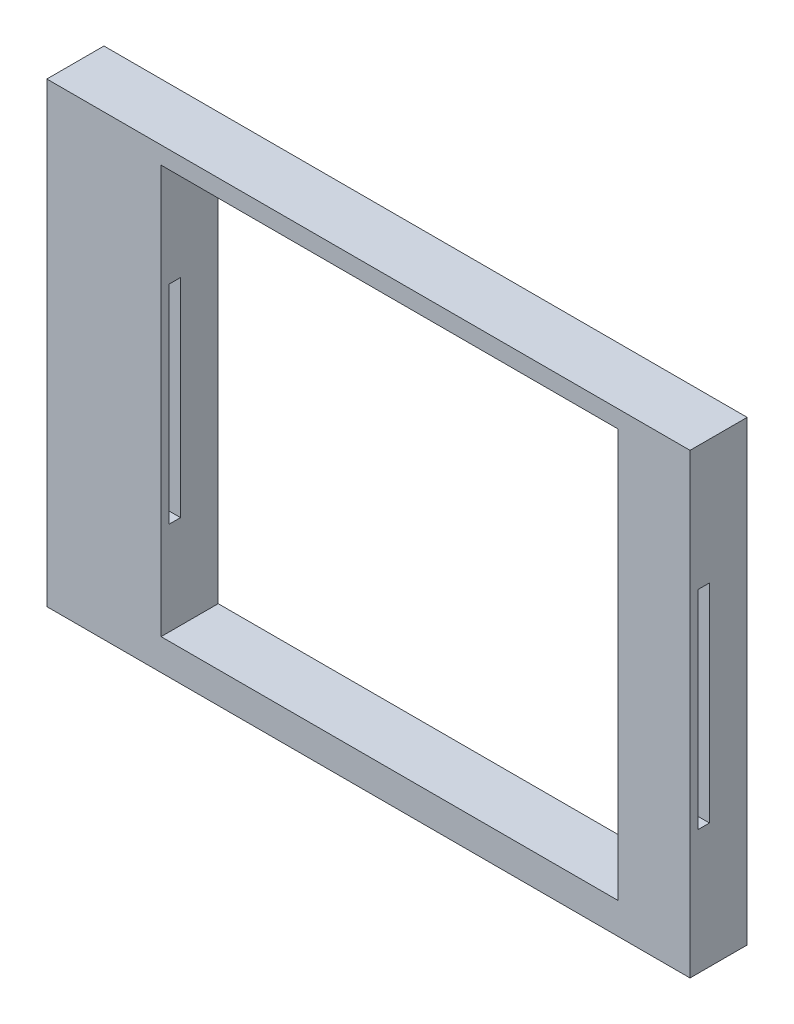
ISO-10303-21;
HEADER;
FILE_DESCRIPTION(('STEP AP214'),'2;1');
FILE_NAME('part.step','',(''),(''),'','','');
FILE_SCHEMA(('AUTOMOTIVE_DESIGN { 1 0 10303 214 1 1 1 1 }'));
ENDSEC;
DATA;
#1=APPLICATION_CONTEXT('core data for automotive mechanical design processes');
#2=APPLICATION_PROTOCOL_DEFINITION('international standard','automotive_design',2000,#1);
#3=PRODUCT_CONTEXT('',#1,'mechanical');
#4=PRODUCT('Part','Part','',(#3));
#5=PRODUCT_RELATED_PRODUCT_CATEGORY('part','',(#4));
#6=PRODUCT_DEFINITION_FORMATION('','',#4);
#7=PRODUCT_DEFINITION_CONTEXT('part definition',#1,'design');
#8=PRODUCT_DEFINITION('design','',#6,#7);
#9=PRODUCT_DEFINITION_SHAPE('','',#8);
#10=(LENGTH_UNIT() NAMED_UNIT(*) SI_UNIT(.MILLI.,.METRE.));
#11=(NAMED_UNIT(*) PLANE_ANGLE_UNIT() SI_UNIT($,.RADIAN.));
#12=(NAMED_UNIT(*) SI_UNIT($,.STERADIAN.) SOLID_ANGLE_UNIT());
#13=UNCERTAINTY_MEASURE_WITH_UNIT(LENGTH_MEASURE(1.E-05),#10,'distance_accuracy_value','');
#14=(GEOMETRIC_REPRESENTATION_CONTEXT(3) GLOBAL_UNCERTAINTY_ASSIGNED_CONTEXT((#13)) GLOBAL_UNIT_ASSIGNED_CONTEXT((#10,
#11,#12)) REPRESENTATION_CONTEXT('',''));
#15=CARTESIAN_POINT('',(0.,0.,0.));
#16=DIRECTION('',(0.,0.,1.));
#17=DIRECTION('',(1.,0.,0.));
#18=AXIS2_PLACEMENT_3D('',#15,#16,#17);
#19=CARTESIAN_POINT('',(0.,0.,5.));
#20=DIRECTION('',(0.,0.,1.));
#21=DIRECTION('',(1.,0.,0.));
#22=AXIS2_PLACEMENT_3D('',#19,#20,#21);
#23=PLANE('',#22);
#24=DIRECTION('',(0.,-1.,0.));
#25=VECTOR('',#24,1.);
#26=CARTESIAN_POINT('',(29.4938577719108,52.3731596494663,5.));
#27=LINE('',#26,#25);
#28=CARTESIAN_POINT('',(29.4938577719108,48.2000310900804,5.));
#29=VERTEX_POINT('',#28);
#30=CARTESIAN_POINT('',(29.4938577719108,8.2000310900804,5.));
#31=VERTEX_POINT('',#30);
#32=EDGE_CURVE('E146',#29,#31,#27,.T.);
#33=ORIENTED_EDGE('',*,*,#32,.F.);
#34=DIRECTION('',(-1.,0.,0.));
#35=VECTOR('',#34,1.);
#36=CARTESIAN_POINT('',(-26.8064344030394,48.2000310900804,5.));
#37=LINE('',#36,#35);
#38=CARTESIAN_POINT('',(-26.8064344030394,48.2000310900804,5.));
#39=VERTEX_POINT('',#38);
#40=EDGE_CURVE('E157',#29,#39,#37,.T.);
#41=ORIENTED_EDGE('',*,*,#40,.T.);
#42=DIRECTION('',(0.,-1.,0.));
#43=VECTOR('',#42,1.);
#44=CARTESIAN_POINT('',(-26.8064344030394,48.2000310900804,5.));
#45=LINE('',#44,#43);
#46=CARTESIAN_POINT('',(-26.8064344030394,8.2000310900804,5.));
#47=VERTEX_POINT('',#46);
#48=EDGE_CURVE('E168',#39,#47,#45,.T.);
#49=ORIENTED_EDGE('',*,*,#48,.T.);
#50=DIRECTION('',(1.,0.,0.));
#51=VECTOR('',#50,1.);
#52=CARTESIAN_POINT('',(-26.8064344030394,8.2000310900804,5.));
#53=LINE('',#52,#51);
#54=EDGE_CURVE('E159',#47,#31,#53,.T.);
#55=ORIENTED_EDGE('',*,*,#54,.T.);
#56=EDGE_LOOP('',(#33,#41,#49,#55));
#57=FACE_BOUND('',#56,.T.);
#58=DIRECTION('',(0.,1.,0.));
#59=VECTOR('',#58,1.);
#60=CARTESIAN_POINT('',(-16.8064344030394,38.2000310900804,5.));
#61=LINE('',#60,#59);
#62=CARTESIAN_POINT('',(-16.8064344030394,46.6700688000078,5.));
#63=VERTEX_POINT('',#62);
#64=CARTESIAN_POINT('',(-16.8064344030394,10.9264458946259,5.));
#65=VERTEX_POINT('',#64);
#66=EDGE_CURVE('E176',#63,#65,#61,.F.);
#67=ORIENTED_EDGE('',*,*,#66,.F.);
#68=DIRECTION('',(-1.,0.,0.));
#69=VECTOR('',#68,1.);
#70=CARTESIAN_POINT('',(-16.8064344030394,46.6700688000078,5.));
#71=LINE('',#70,#69);
#72=CARTESIAN_POINT('',(23.1969632366056,46.6700688000078,5.));
#73=VERTEX_POINT('',#72);
#74=EDGE_CURVE('E221',#73,#63,#71,.T.);
#75=ORIENTED_EDGE('',*,*,#74,.F.);
#76=DIRECTION('',(0.,1.,0.));
#77=VECTOR('',#76,1.);
#78=CARTESIAN_POINT('',(23.1969632366056,10.9264458946259,5.));
#79=LINE('',#78,#77);
#80=CARTESIAN_POINT('',(23.1969632366056,10.9264458946259,5.));
#81=VERTEX_POINT('',#80);
#82=EDGE_CURVE('E209',#81,#73,#79,.T.);
#83=ORIENTED_EDGE('',*,*,#82,.F.);
#84=DIRECTION('',(1.,0.,0.));
#85=VECTOR('',#84,1.);
#86=CARTESIAN_POINT('',(-16.8064344030394,10.9264458946259,5.));
#87=LINE('',#86,#85);
#88=EDGE_CURVE('E279',#65,#81,#87,.T.);
#89=ORIENTED_EDGE('',*,*,#88,.F.);
#90=EDGE_LOOP('',(#67,#75,#83,#89));
#91=FACE_BOUND('',#90,.T.);
#92=ADVANCED_FACE('F34',(#57,#91),#23,.T.);
#93=CARTESIAN_POINT('',(0.,0.,0.));
#94=DIRECTION('',(0.,0.,1.));
#95=DIRECTION('',(1.,0.,0.));
#96=AXIS2_PLACEMENT_3D('',#93,#94,#95);
#97=PLANE('',#96);
#98=DIRECTION('',(-1.,0.,0.));
#99=VECTOR('',#98,1.);
#100=CARTESIAN_POINT('',(-26.8064344030394,48.2000310900804,0.));
#101=LINE('',#100,#99);
#102=CARTESIAN_POINT('',(29.4938577719108,48.2000310900804,0.));
#103=VERTEX_POINT('',#102);
#104=CARTESIAN_POINT('',(-26.8064344030394,48.2000310900804,0.));
#105=VERTEX_POINT('',#104);
#106=EDGE_CURVE('E179',#103,#105,#101,.T.);
#107=ORIENTED_EDGE('',*,*,#106,.F.);
#108=DIRECTION('',(0.,-1.,0.));
#109=VECTOR('',#108,1.);
#110=CARTESIAN_POINT('',(29.4938577719108,0.,0.));
#111=LINE('',#110,#109);
#112=CARTESIAN_POINT('',(29.4938577719108,8.2000310900804,0.));
#113=VERTEX_POINT('',#112);
#114=EDGE_CURVE('E49',#103,#113,#111,.T.);
#115=ORIENTED_EDGE('',*,*,#114,.T.);
#116=DIRECTION('',(1.,0.,0.));
#117=VECTOR('',#116,1.);
#118=CARTESIAN_POINT('',(-26.8064344030394,8.2000310900804,0.));
#119=LINE('',#118,#117);
#120=CARTESIAN_POINT('',(-26.8064344030394,8.2000310900804,0.));
#121=VERTEX_POINT('',#120);
#122=EDGE_CURVE('E175',#121,#113,#119,.T.);
#123=ORIENTED_EDGE('',*,*,#122,.F.);
#124=DIRECTION('',(0.,-1.,0.));
#125=VECTOR('',#124,1.);
#126=CARTESIAN_POINT('',(-26.8064344030394,48.2000310900804,0.));
#127=LINE('',#126,#125);
#128=EDGE_CURVE('E172',#105,#121,#127,.T.);
#129=ORIENTED_EDGE('',*,*,#128,.F.);
#130=EDGE_LOOP('',(#107,#115,#123,#129));
#131=FACE_BOUND('',#130,.T.);
#132=DIRECTION('',(-1.,0.,0.));
#133=VECTOR('',#132,1.);
#134=CARTESIAN_POINT('',(0.,46.6700688000078,0.));
#135=LINE('',#134,#133);
#136=CARTESIAN_POINT('',(23.1969632366056,46.6700688000078,0.));
#137=VERTEX_POINT('',#136);
#138=CARTESIAN_POINT('',(-16.8064344030394,46.6700688000078,0.));
#139=VERTEX_POINT('',#138);
#140=EDGE_CURVE('E42',#137,#139,#135,.T.);
#141=ORIENTED_EDGE('',*,*,#140,.T.);
#142=DIRECTION('',(0.,-1.,0.));
#143=VECTOR('',#142,1.);
#144=CARTESIAN_POINT('',(-16.8064344030394,38.2000310900804,0.));
#145=LINE('',#144,#143);
#146=CARTESIAN_POINT('',(-16.8064344030394,10.9264458946259,0.));
#147=VERTEX_POINT('',#146);
#148=EDGE_CURVE('E185',#139,#147,#145,.T.);
#149=ORIENTED_EDGE('',*,*,#148,.T.);
#150=DIRECTION('',(1.,0.,0.));
#151=VECTOR('',#150,1.);
#152=CARTESIAN_POINT('',(0.,10.9264458946259,0.));
#153=LINE('',#152,#151);
#154=CARTESIAN_POINT('',(23.1969632366056,10.9264458946259,0.));
#155=VERTEX_POINT('',#154);
#156=EDGE_CURVE('E188',#147,#155,#153,.T.);
#157=ORIENTED_EDGE('',*,*,#156,.T.);
#158=DIRECTION('',(0.,1.,0.));
#159=VECTOR('',#158,1.);
#160=CARTESIAN_POINT('',(23.1969632366056,0.,0.));
#161=LINE('',#160,#159);
#162=EDGE_CURVE('E195',#155,#137,#161,.T.);
#163=ORIENTED_EDGE('',*,*,#162,.T.);
#164=EDGE_LOOP('',(#141,#149,#157,#163));
#165=FACE_BOUND('',#164,.T.);
#166=ADVANCED_FACE('F193',(#131,#165),#97,.F.);
#167=CARTESIAN_POINT('',(-26.8064344030394,48.2000310900804,5.));
#168=DIRECTION('',(1.,0.,0.));
#169=DIRECTION('',(0.,0.,-1.));
#170=AXIS2_PLACEMENT_3D('',#167,#168,#169);
#171=PLANE('',#170);
#172=ORIENTED_EDGE('',*,*,#128,.T.);
#173=DIRECTION('',(0.,0.,-1.));
#174=VECTOR('',#173,1.);
#175=CARTESIAN_POINT('',(-26.8064344030394,8.2000310900804,5.));
#176=LINE('',#175,#174);
#177=EDGE_CURVE('E166',#47,#121,#176,.T.);
#178=ORIENTED_EDGE('',*,*,#177,.F.);
#179=ORIENTED_EDGE('',*,*,#48,.F.);
#180=DIRECTION('',(0.,0.,-1.));
#181=VECTOR('',#180,1.);
#182=CARTESIAN_POINT('',(-26.8064344030394,48.2000310900804,5.));
#183=LINE('',#182,#181);
#184=EDGE_CURVE('E163',#39,#105,#183,.T.);
#185=ORIENTED_EDGE('',*,*,#184,.T.);
#186=EDGE_LOOP('',(#172,#178,#179,#185));
#187=FACE_BOUND('',#186,.T.);
#188=ADVANCED_FACE('F36',(#187),#171,.F.);
#189=CARTESIAN_POINT('',(-26.8064344030394,8.2000310900804,5.));
#190=DIRECTION('',(0.,1.,0.));
#191=DIRECTION('',(0.,0.,1.));
#192=AXIS2_PLACEMENT_3D('',#189,#190,#191);
#193=PLANE('',#192);
#194=ORIENTED_EDGE('',*,*,#122,.T.);
#195=DIRECTION('',(0.,0.,1.));
#196=VECTOR('',#195,1.);
#197=CARTESIAN_POINT('',(29.4938577719108,8.2000310900804,5.));
#198=LINE('',#197,#196);
#199=EDGE_CURVE('E278',#113,#31,#198,.T.);
#200=ORIENTED_EDGE('',*,*,#199,.T.);
#201=ORIENTED_EDGE('',*,*,#54,.F.);
#202=ORIENTED_EDGE('',*,*,#177,.T.);
#203=EDGE_LOOP('',(#194,#200,#201,#202));
#204=FACE_BOUND('',#203,.T.);
#205=ADVANCED_FACE('F277',(#204),#193,.F.);
#206=CARTESIAN_POINT('',(-26.8064344030394,48.2000310900804,5.));
#207=DIRECTION('',(0.,-1.,0.));
#208=DIRECTION('',(0.,0.,-1.));
#209=AXIS2_PLACEMENT_3D('',#206,#207,#208);
#210=PLANE('',#209);
#211=ORIENTED_EDGE('',*,*,#40,.F.);
#212=DIRECTION('',(0.,0.,-1.));
#213=VECTOR('',#212,1.);
#214=CARTESIAN_POINT('',(29.4938577719108,48.2000310900804,5.));
#215=LINE('',#214,#213);
#216=EDGE_CURVE('E143',#29,#103,#215,.T.);
#217=ORIENTED_EDGE('',*,*,#216,.T.);
#218=ORIENTED_EDGE('',*,*,#106,.T.);
#219=ORIENTED_EDGE('',*,*,#184,.F.);
#220=EDGE_LOOP('',(#211,#217,#218,#219));
#221=FACE_BOUND('',#220,.T.);
#222=ADVANCED_FACE('F161',(#221),#210,.F.);
#223=CARTESIAN_POINT('',(-16.8064344030394,38.2000310900804,5.));
#224=DIRECTION('',(1.,0.,0.));
#225=DIRECTION('',(0.,1.,0.));
#226=AXIS2_PLACEMENT_3D('',#223,#224,#225);
#227=PLANE('',#226);
#228=DIRECTION('',(0.,-1.,0.));
#229=VECTOR('',#228,1.);
#230=CARTESIAN_POINT('',(-16.8064344030394,37.3000310900804,4.3));
#231=LINE('',#230,#229);
#232=CARTESIAN_POINT('',(-16.8064344030394,37.3000310900804,4.3));
#233=VERTEX_POINT('',#232);
#234=CARTESIAN_POINT('',(-16.8064344030394,19.1000310900804,4.3));
#235=VERTEX_POINT('',#234);
#236=EDGE_CURVE('E234',#233,#235,#231,.T.);
#237=ORIENTED_EDGE('',*,*,#236,.F.);
#238=DIRECTION('',(0.,0.,1.));
#239=VECTOR('',#238,1.);
#240=CARTESIAN_POINT('',(-16.8064344030394,37.3000310900804,4.3));
#241=LINE('',#240,#239);
#242=CARTESIAN_POINT('',(-16.8064344030394,37.3000310900804,3.3));
#243=VERTEX_POINT('',#242);
#244=EDGE_CURVE('E244',#243,#233,#241,.T.);
#245=ORIENTED_EDGE('',*,*,#244,.F.);
#246=DIRECTION('',(0.,1.,0.));
#247=VECTOR('',#246,1.);
#248=CARTESIAN_POINT('',(-16.8064344030394,37.3000310900804,3.3));
#249=LINE('',#248,#247);
#250=CARTESIAN_POINT('',(-16.8064344030394,19.1000310900804,3.3));
#251=VERTEX_POINT('',#250);
#252=EDGE_CURVE('E258',#251,#243,#249,.T.);
#253=ORIENTED_EDGE('',*,*,#252,.F.);
#254=DIRECTION('',(0.,0.,-1.));
#255=VECTOR('',#254,1.);
#256=CARTESIAN_POINT('',(-16.8064344030394,19.1000310900804,4.3));
#257=LINE('',#256,#255);
#258=EDGE_CURVE('E255',#235,#251,#257,.T.);
#259=ORIENTED_EDGE('',*,*,#258,.F.);
#260=EDGE_LOOP('',(#237,#245,#253,#259));
#261=FACE_BOUND('',#260,.T.);
#262=ORIENTED_EDGE('',*,*,#66,.T.);
#263=DIRECTION('',(0.,0.,1.));
#264=VECTOR('',#263,1.);
#265=CARTESIAN_POINT('',(-16.8064344030394,10.9264458946259,-2.));
#266=LINE('',#265,#264);
#267=EDGE_CURVE('E215',#147,#65,#266,.T.);
#268=ORIENTED_EDGE('',*,*,#267,.F.);
#269=ORIENTED_EDGE('',*,*,#148,.F.);
#270=DIRECTION('',(0.,0.,1.));
#271=VECTOR('',#270,1.);
#272=CARTESIAN_POINT('',(-16.8064344030394,46.6700688000078,-2.));
#273=LINE('',#272,#271);
#274=EDGE_CURVE('E204',#139,#63,#273,.T.);
#275=ORIENTED_EDGE('',*,*,#274,.T.);
#276=EDGE_LOOP('',(#262,#268,#269,#275));
#277=FACE_BOUND('',#276,.T.);
#278=ADVANCED_FACE('F288',(#261,#277),#227,.T.);
#279=CARTESIAN_POINT('',(-23.8064344030394,37.3000310900804,4.3));
#280=DIRECTION('',(0.,0.,1.));
#281=DIRECTION('',(0.,-1.,0.));
#282=AXIS2_PLACEMENT_3D('',#279,#280,#281);
#283=PLANE('',#282);
#284=ORIENTED_EDGE('',*,*,#236,.T.);
#285=DIRECTION('',(1.,0.,0.));
#286=VECTOR('',#285,1.);
#287=CARTESIAN_POINT('',(-23.8064344030394,19.1000310900804,4.3));
#288=LINE('',#287,#286);
#289=CARTESIAN_POINT('',(-23.8064344030394,19.1000310900804,4.3));
#290=VERTEX_POINT('',#289);
#291=EDGE_CURVE('E253',#290,#235,#288,.T.);
#292=ORIENTED_EDGE('',*,*,#291,.F.);
#293=DIRECTION('',(0.,-1.,0.));
#294=VECTOR('',#293,1.);
#295=CARTESIAN_POINT('',(-23.8064344030394,37.3000310900804,4.3));
#296=LINE('',#295,#294);
#297=CARTESIAN_POINT('',(-23.8064344030394,37.3000310900804,4.3));
#298=VERTEX_POINT('',#297);
#299=EDGE_CURVE('E240',#298,#290,#296,.T.);
#300=ORIENTED_EDGE('',*,*,#299,.F.);
#301=DIRECTION('',(1.,0.,0.));
#302=VECTOR('',#301,1.);
#303=CARTESIAN_POINT('',(-23.8064344030394,37.3000310900804,4.3));
#304=LINE('',#303,#302);
#305=EDGE_CURVE('E263',#298,#233,#304,.T.);
#306=ORIENTED_EDGE('',*,*,#305,.T.);
#307=EDGE_LOOP('',(#284,#292,#300,#306));
#308=FACE_BOUND('',#307,.T.);
#309=ADVANCED_FACE('F408',(#308),#283,.F.);
#310=CARTESIAN_POINT('',(-23.8064344030394,37.3000310900804,4.3));
#311=DIRECTION('',(0.,1.,0.));
#312=DIRECTION('',(-1.,0.,0.));
#313=AXIS2_PLACEMENT_3D('',#310,#311,#312);
#314=PLANE('',#313);
#315=ORIENTED_EDGE('',*,*,#244,.T.);
#316=ORIENTED_EDGE('',*,*,#305,.F.);
#317=DIRECTION('',(0.,0.,1.));
#318=VECTOR('',#317,1.);
#319=CARTESIAN_POINT('',(-23.8064344030394,37.3000310900804,4.3));
#320=LINE('',#319,#318);
#321=CARTESIAN_POINT('',(-23.8064344030394,37.3000310900804,3.3));
#322=VERTEX_POINT('',#321);
#323=EDGE_CURVE('E250',#322,#298,#320,.T.);
#324=ORIENTED_EDGE('',*,*,#323,.F.);
#325=DIRECTION('',(1.,0.,0.));
#326=VECTOR('',#325,1.);
#327=CARTESIAN_POINT('',(-23.8064344030394,37.3000310900804,3.3));
#328=LINE('',#327,#326);
#329=EDGE_CURVE('E265',#322,#243,#328,.T.);
#330=ORIENTED_EDGE('',*,*,#329,.T.);
#331=EDGE_LOOP('',(#315,#316,#324,#330));
#332=FACE_BOUND('',#331,.T.);
#333=ADVANCED_FACE('F440',(#332),#314,.F.);
#334=CARTESIAN_POINT('',(-23.8064344030394,37.3000310900804,3.3));
#335=DIRECTION('',(0.,0.,-1.));
#336=DIRECTION('',(0.,1.,0.));
#337=AXIS2_PLACEMENT_3D('',#334,#335,#336);
#338=PLANE('',#337);
#339=ORIENTED_EDGE('',*,*,#252,.T.);
#340=ORIENTED_EDGE('',*,*,#329,.F.);
#341=DIRECTION('',(0.,1.,0.));
#342=VECTOR('',#341,1.);
#343=CARTESIAN_POINT('',(-23.8064344030394,37.3000310900804,3.3));
#344=LINE('',#343,#342);
#345=CARTESIAN_POINT('',(-23.8064344030394,19.1000310900804,3.3));
#346=VERTEX_POINT('',#345);
#347=EDGE_CURVE('E247',#346,#322,#344,.T.);
#348=ORIENTED_EDGE('',*,*,#347,.F.);
#349=DIRECTION('',(1.,0.,0.));
#350=VECTOR('',#349,1.);
#351=CARTESIAN_POINT('',(-23.8064344030394,19.1000310900804,3.3));
#352=LINE('',#351,#350);
#353=EDGE_CURVE('E267',#346,#251,#352,.T.);
#354=ORIENTED_EDGE('',*,*,#353,.T.);
#355=EDGE_LOOP('',(#339,#340,#348,#354));
#356=FACE_BOUND('',#355,.T.);
#357=ADVANCED_FACE('F430',(#356),#338,.F.);
#358=CARTESIAN_POINT('',(-23.8064344030394,19.1000310900804,4.3));
#359=DIRECTION('',(0.,-1.,0.));
#360=DIRECTION('',(1.,0.,0.));
#361=AXIS2_PLACEMENT_3D('',#358,#359,#360);
#362=PLANE('',#361);
#363=ORIENTED_EDGE('',*,*,#258,.T.);
#364=ORIENTED_EDGE('',*,*,#353,.F.);
#365=DIRECTION('',(0.,0.,-1.));
#366=VECTOR('',#365,1.);
#367=CARTESIAN_POINT('',(-23.8064344030394,19.1000310900804,4.3));
#368=LINE('',#367,#366);
#369=EDGE_CURVE('E243',#290,#346,#368,.T.);
#370=ORIENTED_EDGE('',*,*,#369,.F.);
#371=ORIENTED_EDGE('',*,*,#291,.T.);
#372=EDGE_LOOP('',(#363,#364,#370,#371));
#373=FACE_BOUND('',#372,.T.);
#374=ADVANCED_FACE('F420',(#373),#362,.F.);
#375=CARTESIAN_POINT('',(-23.8064344030394,0.,0.));
#376=DIRECTION('',(1.,0.,0.));
#377=DIRECTION('',(0.,1.,0.));
#378=AXIS2_PLACEMENT_3D('',#375,#376,#377);
#379=PLANE('',#378);
#380=ORIENTED_EDGE('',*,*,#299,.T.);
#381=ORIENTED_EDGE('',*,*,#369,.T.);
#382=ORIENTED_EDGE('',*,*,#347,.T.);
#383=ORIENTED_EDGE('',*,*,#323,.T.);
#384=EDGE_LOOP('',(#380,#381,#382,#383));
#385=FACE_BOUND('',#384,.T.);
#386=ADVANCED_FACE('F300',(#385),#379,.T.);
#387=CARTESIAN_POINT('',(-16.8064344030394,46.6700688000078,-2.));
#388=DIRECTION('',(0.,1.,0.));
#389=DIRECTION('',(0.,0.,1.));
#390=AXIS2_PLACEMENT_3D('',#387,#388,#389);
#391=PLANE('',#390);
#392=DIRECTION('',(0.,0.,1.));
#393=VECTOR('',#392,1.);
#394=CARTESIAN_POINT('',(23.1969632366056,46.6700688000078,-2.));
#395=LINE('',#394,#393);
#396=EDGE_CURVE('E201',#137,#73,#395,.T.);
#397=ORIENTED_EDGE('',*,*,#396,.T.);
#398=ORIENTED_EDGE('',*,*,#74,.T.);
#399=ORIENTED_EDGE('',*,*,#274,.F.);
#400=ORIENTED_EDGE('',*,*,#140,.F.);
#401=EDGE_LOOP('',(#397,#398,#399,#400));
#402=FACE_BOUND('',#401,.T.);
#403=ADVANCED_FACE('F199',(#402),#391,.F.);
#404=CARTESIAN_POINT('',(-16.8064344030394,10.9264458946259,-2.));
#405=DIRECTION('',(0.,-1.,0.));
#406=DIRECTION('',(0.,0.,-1.));
#407=AXIS2_PLACEMENT_3D('',#404,#405,#406);
#408=PLANE('',#407);
#409=ORIENTED_EDGE('',*,*,#267,.T.);
#410=ORIENTED_EDGE('',*,*,#88,.T.);
#411=DIRECTION('',(0.,0.,1.));
#412=VECTOR('',#411,1.);
#413=CARTESIAN_POINT('',(23.1969632366056,10.9264458946259,-2.));
#414=LINE('',#413,#412);
#415=EDGE_CURVE('E211',#155,#81,#414,.T.);
#416=ORIENTED_EDGE('',*,*,#415,.F.);
#417=ORIENTED_EDGE('',*,*,#156,.F.);
#418=EDGE_LOOP('',(#409,#410,#416,#417));
#419=FACE_BOUND('',#418,.T.);
#420=ADVANCED_FACE('F290',(#419),#408,.F.);
#421=CARTESIAN_POINT('',(23.1969632366056,10.9264458946259,-2.));
#422=DIRECTION('',(1.,0.,0.));
#423=DIRECTION('',(0.,1.,0.));
#424=AXIS2_PLACEMENT_3D('',#421,#422,#423);
#425=PLANE('',#424);
#426=DIRECTION('',(0.,0.,-1.));
#427=VECTOR('',#426,1.);
#428=CARTESIAN_POINT('',(23.1969632366056,37.3000310900804,3.3));
#429=LINE('',#428,#427);
#430=CARTESIAN_POINT('',(23.1969632366056,37.3000310900804,4.3));
#431=VERTEX_POINT('',#430);
#432=CARTESIAN_POINT('',(23.1969632366056,37.3000310900804,3.3));
#433=VERTEX_POINT('',#432);
#434=EDGE_CURVE('E224',#431,#433,#429,.T.);
#435=ORIENTED_EDGE('',*,*,#434,.F.);
#436=DIRECTION('',(0.,1.,0.));
#437=VECTOR('',#436,1.);
#438=CARTESIAN_POINT('',(23.1969632366056,37.3000310900804,4.3));
#439=LINE('',#438,#437);
#440=CARTESIAN_POINT('',(23.1969632366056,19.1000310900804,4.3));
#441=VERTEX_POINT('',#440);
#442=EDGE_CURVE('E213',#441,#431,#439,.T.);
#443=ORIENTED_EDGE('',*,*,#442,.F.);
#444=DIRECTION('',(0.,0.,1.));
#445=VECTOR('',#444,1.);
#446=CARTESIAN_POINT('',(23.1969632366056,19.1000310900804,3.3));
#447=LINE('',#446,#445);
#448=CARTESIAN_POINT('',(23.1969632366056,19.1000310900804,3.3));
#449=VERTEX_POINT('',#448);
#450=EDGE_CURVE('E183',#449,#441,#447,.T.);
#451=ORIENTED_EDGE('',*,*,#450,.F.);
#452=DIRECTION('',(0.,-1.,0.));
#453=VECTOR('',#452,1.);
#454=CARTESIAN_POINT('',(23.1969632366056,37.3000310900804,3.3));
#455=LINE('',#454,#453);
#456=EDGE_CURVE('E227',#433,#449,#455,.T.);
#457=ORIENTED_EDGE('',*,*,#456,.F.);
#458=EDGE_LOOP('',(#435,#443,#451,#457));
#459=FACE_BOUND('',#458,.T.);
#460=ORIENTED_EDGE('',*,*,#415,.T.);
#461=ORIENTED_EDGE('',*,*,#82,.T.);
#462=ORIENTED_EDGE('',*,*,#396,.F.);
#463=ORIENTED_EDGE('',*,*,#162,.F.);
#464=EDGE_LOOP('',(#460,#461,#462,#463));
#465=FACE_BOUND('',#464,.T.);
#466=ADVANCED_FACE('F206',(#459,#465),#425,.F.);
#467=CARTESIAN_POINT('',(30.1935655969606,19.1000310900804,3.3));
#468=DIRECTION('',(0.,-1.,0.));
#469=DIRECTION('',(1.,0.,0.));
#470=AXIS2_PLACEMENT_3D('',#467,#468,#469);
#471=PLANE('',#470);
#472=DIRECTION('',(-1.,0.,0.));
#473=VECTOR('',#472,1.);
#474=CARTESIAN_POINT('',(30.1935655969606,19.1000310900804,4.3));
#475=LINE('',#474,#473);
#476=CARTESIAN_POINT('',(29.4938577719108,19.1000310900804,4.3));
#477=VERTEX_POINT('',#476);
#478=EDGE_CURVE('E237',#477,#441,#475,.T.);
#479=ORIENTED_EDGE('',*,*,#478,.F.);
#480=DIRECTION('',(0.,0.,-1.));
#481=VECTOR('',#480,1.);
#482=CARTESIAN_POINT('',(29.4938577719108,19.1000310900804,3.3));
#483=LINE('',#482,#481);
#484=CARTESIAN_POINT('',(29.4938577719108,19.1000310900804,3.3));
#485=VERTEX_POINT('',#484);
#486=EDGE_CURVE('E151',#477,#485,#483,.T.);
#487=ORIENTED_EDGE('',*,*,#486,.T.);
#488=DIRECTION('',(-1.,0.,0.));
#489=VECTOR('',#488,1.);
#490=CARTESIAN_POINT('',(30.1935655969606,19.1000310900804,3.3));
#491=LINE('',#490,#489);
#492=EDGE_CURVE('E231',#485,#449,#491,.T.);
#493=ORIENTED_EDGE('',*,*,#492,.T.);
#494=ORIENTED_EDGE('',*,*,#450,.T.);
#495=EDGE_LOOP('',(#479,#487,#493,#494));
#496=FACE_BOUND('',#495,.T.);
#497=ADVANCED_FACE('F297',(#496),#471,.F.);
#498=CARTESIAN_POINT('',(30.1935655969606,37.3000310900804,4.3));
#499=DIRECTION('',(0.,0.,1.));
#500=DIRECTION('',(0.,-1.,0.));
#501=AXIS2_PLACEMENT_3D('',#498,#499,#500);
#502=PLANE('',#501);
#503=DIRECTION('',(-1.,0.,0.));
#504=VECTOR('',#503,1.);
#505=CARTESIAN_POINT('',(30.1935655969606,37.3000310900804,4.3));
#506=LINE('',#505,#504);
#507=CARTESIAN_POINT('',(29.4938577719108,37.3000310900804,4.3));
#508=VERTEX_POINT('',#507);
#509=EDGE_CURVE('E235',#508,#431,#506,.T.);
#510=ORIENTED_EDGE('',*,*,#509,.F.);
#511=DIRECTION('',(0.,-1.,0.));
#512=VECTOR('',#511,1.);
#513=CARTESIAN_POINT('',(29.4938577719108,37.3000310900804,4.3));
#514=LINE('',#513,#512);
#515=EDGE_CURVE('E472',#508,#477,#514,.T.);
#516=ORIENTED_EDGE('',*,*,#515,.T.);
#517=ORIENTED_EDGE('',*,*,#478,.T.);
#518=ORIENTED_EDGE('',*,*,#442,.T.);
#519=EDGE_LOOP('',(#510,#516,#517,#518));
#520=FACE_BOUND('',#519,.T.);
#521=ADVANCED_FACE('F348',(#520),#502,.F.);
#522=CARTESIAN_POINT('',(30.1935655969606,37.3000310900804,3.3));
#523=DIRECTION('',(0.,1.,0.));
#524=DIRECTION('',(-1.,0.,0.));
#525=AXIS2_PLACEMENT_3D('',#522,#523,#524);
#526=PLANE('',#525);
#527=DIRECTION('',(-1.,0.,0.));
#528=VECTOR('',#527,1.);
#529=CARTESIAN_POINT('',(30.1935655969606,37.3000310900804,3.3));
#530=LINE('',#529,#528);
#531=CARTESIAN_POINT('',(29.4938577719108,37.3000310900804,3.3));
#532=VERTEX_POINT('',#531);
#533=EDGE_CURVE('E232',#532,#433,#530,.T.);
#534=ORIENTED_EDGE('',*,*,#533,.F.);
#535=DIRECTION('',(0.,0.,1.));
#536=VECTOR('',#535,1.);
#537=CARTESIAN_POINT('',(29.4938577719108,37.3000310900804,3.3));
#538=LINE('',#537,#536);
#539=EDGE_CURVE('E57',#532,#508,#538,.T.);
#540=ORIENTED_EDGE('',*,*,#539,.T.);
#541=ORIENTED_EDGE('',*,*,#509,.T.);
#542=ORIENTED_EDGE('',*,*,#434,.T.);
#543=EDGE_LOOP('',(#534,#540,#541,#542));
#544=FACE_BOUND('',#543,.T.);
#545=ADVANCED_FACE('F359',(#544),#526,.F.);
#546=CARTESIAN_POINT('',(30.1935655969606,37.3000310900804,3.3));
#547=DIRECTION('',(0.,0.,-1.));
#548=DIRECTION('',(0.,1.,0.));
#549=AXIS2_PLACEMENT_3D('',#546,#547,#548);
#550=PLANE('',#549);
#551=ORIENTED_EDGE('',*,*,#492,.F.);
#552=DIRECTION('',(0.,1.,0.));
#553=VECTOR('',#552,1.);
#554=CARTESIAN_POINT('',(29.4938577719108,37.3000310900804,3.3));
#555=LINE('',#554,#553);
#556=EDGE_CURVE('E12',#485,#532,#555,.T.);
#557=ORIENTED_EDGE('',*,*,#556,.T.);
#558=ORIENTED_EDGE('',*,*,#533,.T.);
#559=ORIENTED_EDGE('',*,*,#456,.T.);
#560=EDGE_LOOP('',(#551,#557,#558,#559));
#561=FACE_BOUND('',#560,.T.);
#562=ADVANCED_FACE('F369',(#561),#550,.F.);
#563=CARTESIAN_POINT('',(29.4938577719108,52.3731596494663,-2.));
#564=DIRECTION('',(-1.,0.,0.));
#565=DIRECTION('',(0.,-1.,0.));
#566=AXIS2_PLACEMENT_3D('',#563,#564,#565);
#567=PLANE('',#566);
#568=ORIENTED_EDGE('',*,*,#515,.F.);
#569=ORIENTED_EDGE('',*,*,#539,.F.);
#570=ORIENTED_EDGE('',*,*,#556,.F.);
#571=ORIENTED_EDGE('',*,*,#486,.F.);
#572=EDGE_LOOP('',(#568,#569,#570,#571));
#573=FACE_BOUND('',#572,.T.);
#574=ORIENTED_EDGE('',*,*,#114,.F.);
#575=ORIENTED_EDGE('',*,*,#216,.F.);
#576=ORIENTED_EDGE('',*,*,#32,.T.);
#577=ORIENTED_EDGE('',*,*,#199,.F.);
#578=EDGE_LOOP('',(#574,#575,#576,#577));
#579=FACE_BOUND('',#578,.T.);
#580=ADVANCED_FACE('F145',(#573,#579),#567,.F.);
#581=CLOSED_SHELL('',(#92,#166,#188,#205,#222,#278,#309,#333,#357,#374,#386,#403,#420,#466,#497,
#521,#545,#562,#580));
#582=MANIFOLD_SOLID_BREP('B2',#581);
#583=ADVANCED_BREP_SHAPE_REPRESENTATION('',(#18,#582),#14);
#584=SHAPE_DEFINITION_REPRESENTATION(#9,#583);
ENDSEC;
END-ISO-10303-21;
